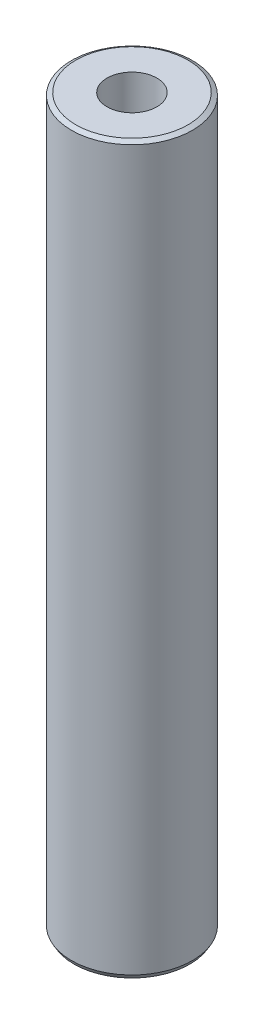
ISO-10303-21;
HEADER;
FILE_DESCRIPTION(('STEP AP214'),'2;1');
FILE_NAME('part.step','',(''),(''),'','','');
FILE_SCHEMA(('AUTOMOTIVE_DESIGN { 1 0 10303 214 1 1 1 1 }'));
ENDSEC;
DATA;
#1=APPLICATION_CONTEXT('core data for automotive mechanical design processes');
#2=APPLICATION_PROTOCOL_DEFINITION('international standard','automotive_design',2000,#1);
#3=PRODUCT_CONTEXT('',#1,'mechanical');
#4=PRODUCT('Part','Part','',(#3));
#5=PRODUCT_RELATED_PRODUCT_CATEGORY('part','',(#4));
#6=PRODUCT_DEFINITION_FORMATION('','',#4);
#7=PRODUCT_DEFINITION_CONTEXT('part definition',#1,'design');
#8=PRODUCT_DEFINITION('design','',#6,#7);
#9=PRODUCT_DEFINITION_SHAPE('','',#8);
#10=(LENGTH_UNIT() NAMED_UNIT(*) SI_UNIT(.MILLI.,.METRE.));
#11=(NAMED_UNIT(*) PLANE_ANGLE_UNIT() SI_UNIT($,.RADIAN.));
#12=(NAMED_UNIT(*) SI_UNIT($,.STERADIAN.) SOLID_ANGLE_UNIT());
#13=UNCERTAINTY_MEASURE_WITH_UNIT(LENGTH_MEASURE(1.E-05),#10,'distance_accuracy_value','');
#14=(GEOMETRIC_REPRESENTATION_CONTEXT(3) GLOBAL_UNCERTAINTY_ASSIGNED_CONTEXT((#13)) GLOBAL_UNIT_ASSIGNED_CONTEXT((#10,
#11,#12)) REPRESENTATION_CONTEXT('',''));
#15=CARTESIAN_POINT('',(0.,0.,0.));
#16=DIRECTION('',(0.,0.,1.));
#17=DIRECTION('',(1.,0.,0.));
#18=AXIS2_PLACEMENT_3D('',#15,#16,#17);
#19=CARTESIAN_POINT('',(0.,600.,0.));
#20=DIRECTION('',(0.,-1.,0.));
#21=DIRECTION('',(0.,0.,-1.));
#22=AXIS2_PLACEMENT_3D('',#19,#20,#21);
#23=CYLINDRICAL_SURFACE('',#22,50.);
#24=CARTESIAN_POINT('',(0.,597.894354590093,0.));
#25=DIRECTION('',(0.,1.,0.));
#26=DIRECTION('',(0.,0.,1.));
#27=AXIS2_PLACEMENT_3D('',#24,#25,#26);
#28=CIRCLE('',#27,50.);
#29=CARTESIAN_POINT('',(0.,597.894354590093,50.));
#30=VERTEX_POINT('',#29);
#31=EDGE_CURVE('E50',#30,#30,#28,.F.);
#32=ORIENTED_EDGE('',*,*,#31,.T.);
#33=EDGE_LOOP('',(#32));
#34=FACE_BOUND('',#33,.T.);
#35=CARTESIAN_POINT('',(0.,3.64708483268306,0.));
#36=DIRECTION('',(0.,1.,0.));
#37=DIRECTION('',(0.,0.,1.));
#38=AXIS2_PLACEMENT_3D('',#35,#36,#37);
#39=CIRCLE('',#38,50.);
#40=CARTESIAN_POINT('',(0.,3.64708483268306,50.));
#41=VERTEX_POINT('',#40);
#42=EDGE_CURVE('E51',#41,#41,#39,.T.);
#43=ORIENTED_EDGE('',*,*,#42,.T.);
#44=EDGE_LOOP('',(#43));
#45=FACE_BOUND('',#44,.T.);
#46=ADVANCED_FACE('F39',(#34,#45),#23,.T.);
#47=CARTESIAN_POINT('',(0.,600.,0.));
#48=DIRECTION('',(0.,1.,0.));
#49=DIRECTION('',(0.,0.,1.));
#50=AXIS2_PLACEMENT_3D('',#47,#48,#49);
#51=PLANE('',#50);
#52=CARTESIAN_POINT('',(0.,600.,0.));
#53=DIRECTION('',(0.,1.,0.));
#54=DIRECTION('',(0.,0.,1.));
#55=AXIS2_PLACEMENT_3D('',#52,#53,#54);
#56=CIRCLE('',#55,46.352915167317);
#57=CARTESIAN_POINT('',(0.,600.,46.352915167317));
#58=VERTEX_POINT('',#57);
#59=EDGE_CURVE('E54',#58,#58,#56,.T.);
#60=ORIENTED_EDGE('',*,*,#59,.T.);
#61=EDGE_LOOP('',(#60));
#62=FACE_BOUND('',#61,.T.);
#63=CARTESIAN_POINT('',(0.,600.,0.));
#64=DIRECTION('',(0.,1.,0.));
#65=DIRECTION('',(0.,0.,1.));
#66=AXIS2_PLACEMENT_3D('',#63,#64,#65);
#67=CIRCLE('',#66,20.6193989352578);
#68=CARTESIAN_POINT('',(0.,600.,20.6193989352578));
#69=VERTEX_POINT('',#68);
#70=EDGE_CURVE('E58',#69,#69,#67,.T.);
#71=ORIENTED_EDGE('',*,*,#70,.F.);
#72=EDGE_LOOP('',(#71));
#73=FACE_BOUND('',#72,.T.);
#74=ADVANCED_FACE('F69',(#62,#73),#51,.T.);
#75=CARTESIAN_POINT('',(0.,0.,0.));
#76=DIRECTION('',(0.,1.,0.));
#77=DIRECTION('',(0.,0.,1.));
#78=AXIS2_PLACEMENT_3D('',#75,#76,#77);
#79=PLANE('',#78);
#80=CARTESIAN_POINT('',(0.,0.,0.));
#81=DIRECTION('',(0.,1.,0.));
#82=DIRECTION('',(0.,0.,1.));
#83=AXIS2_PLACEMENT_3D('',#80,#81,#82);
#84=CIRCLE('',#83,47.8943545900931);
#85=CARTESIAN_POINT('',(0.,0.,47.8943545900931));
#86=VERTEX_POINT('',#85);
#87=EDGE_CURVE('E10',#86,#86,#84,.F.);
#88=ORIENTED_EDGE('',*,*,#87,.T.);
#89=EDGE_LOOP('',(#88));
#90=FACE_BOUND('',#89,.T.);
#91=CARTESIAN_POINT('',(0.,0.,0.));
#92=DIRECTION('',(0.,1.,0.));
#93=DIRECTION('',(0.,0.,1.));
#94=AXIS2_PLACEMENT_3D('',#91,#92,#93);
#95=CIRCLE('',#94,20.6193989352578);
#96=CARTESIAN_POINT('',(0.,0.,20.6193989352578));
#97=VERTEX_POINT('',#96);
#98=EDGE_CURVE('E63',#97,#97,#95,.T.);
#99=ORIENTED_EDGE('',*,*,#98,.T.);
#100=EDGE_LOOP('',(#99));
#101=FACE_BOUND('',#100,.T.);
#102=ADVANCED_FACE('F75',(#90,#101),#79,.F.);
#103=CARTESIAN_POINT('',(0.,600.,0.));
#104=DIRECTION('',(0.,-1.,0.));
#105=DIRECTION('',(0.,0.,-1.));
#106=AXIS2_PLACEMENT_3D('',#103,#104,#105);
#107=CYLINDRICAL_SURFACE('',#106,20.6193989352578);
#108=ORIENTED_EDGE('',*,*,#70,.T.);
#109=EDGE_LOOP('',(#108));
#110=FACE_BOUND('',#109,.T.);
#111=ORIENTED_EDGE('',*,*,#98,.F.);
#112=EDGE_LOOP('',(#111));
#113=FACE_BOUND('',#112,.T.);
#114=ADVANCED_FACE('F70',(#110,#113),#107,.F.);
#115=CARTESIAN_POINT('',(0.,600.,0.));
#116=DIRECTION('',(0.,-1.,0.));
#117=DIRECTION('',(0.,0.,-1.));
#118=AXIS2_PLACEMENT_3D('',#115,#116,#117);
#119=CONICAL_SURFACE('',#118,46.352915167317,1.04719755119661);
#120=ORIENTED_EDGE('',*,*,#31,.F.);
#121=EDGE_LOOP('',(#120));
#122=FACE_BOUND('',#121,.T.);
#123=ORIENTED_EDGE('',*,*,#59,.F.);
#124=EDGE_LOOP('',(#123));
#125=FACE_BOUND('',#124,.T.);
#126=ADVANCED_FACE('F81',(#122,#125),#119,.T.);
#127=CARTESIAN_POINT('',(0.,3.64708483268306,0.));
#128=DIRECTION('',(0.,1.,0.));
#129=DIRECTION('',(0.,0.,1.));
#130=AXIS2_PLACEMENT_3D('',#127,#128,#129);
#131=CONICAL_SURFACE('',#130,50.,0.523598775598295);
#132=ORIENTED_EDGE('',*,*,#87,.F.);
#133=EDGE_LOOP('',(#132));
#134=FACE_BOUND('',#133,.T.);
#135=ORIENTED_EDGE('',*,*,#42,.F.);
#136=EDGE_LOOP('',(#135));
#137=FACE_BOUND('',#136,.T.);
#138=ADVANCED_FACE('F45',(#134,#137),#131,.T.);
#139=CLOSED_SHELL('',(#46,#74,#102,#114,#126,#138));
#140=MANIFOLD_SOLID_BREP('B2',#139);
#141=ADVANCED_BREP_SHAPE_REPRESENTATION('',(#18,#140),#14);
#142=SHAPE_DEFINITION_REPRESENTATION(#9,#141);
ENDSEC;
END-ISO-10303-21;
